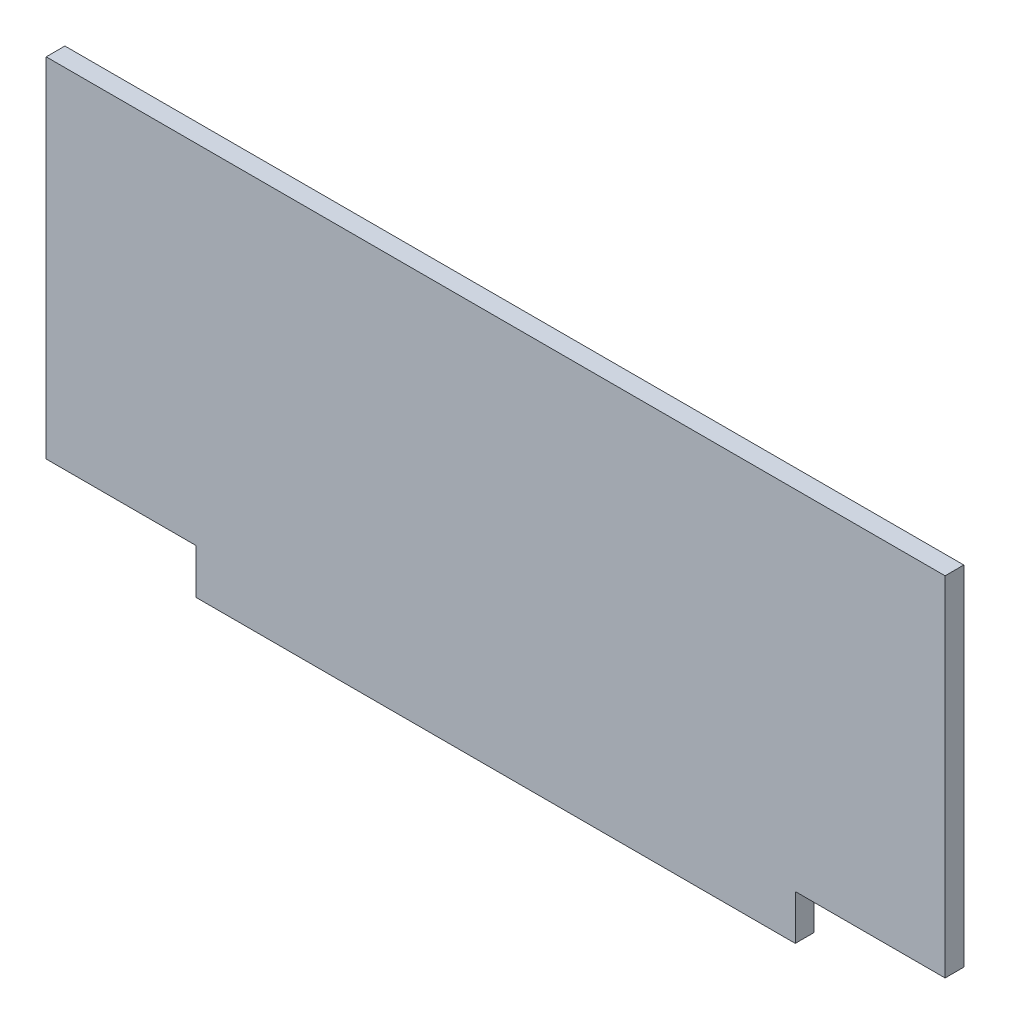
ISO-10303-21;
HEADER;
FILE_DESCRIPTION(('STEP AP214'),'2;1');
FILE_NAME('part.step','',(''),(''),'','','');
FILE_SCHEMA(('AUTOMOTIVE_DESIGN { 1 0 10303 214 1 1 1 1 }'));
ENDSEC;
DATA;
#1=APPLICATION_CONTEXT('core data for automotive mechanical design processes');
#2=APPLICATION_PROTOCOL_DEFINITION('international standard','automotive_design',2000,#1);
#3=PRODUCT_CONTEXT('',#1,'mechanical');
#4=PRODUCT('Part','Part','',(#3));
#5=PRODUCT_RELATED_PRODUCT_CATEGORY('part','',(#4));
#6=PRODUCT_DEFINITION_FORMATION('','',#4);
#7=PRODUCT_DEFINITION_CONTEXT('part definition',#1,'design');
#8=PRODUCT_DEFINITION('design','',#6,#7);
#9=PRODUCT_DEFINITION_SHAPE('','',#8);
#10=(LENGTH_UNIT() NAMED_UNIT(*) SI_UNIT(.MILLI.,.METRE.));
#11=(NAMED_UNIT(*) PLANE_ANGLE_UNIT() SI_UNIT($,.RADIAN.));
#12=(NAMED_UNIT(*) SI_UNIT($,.STERADIAN.) SOLID_ANGLE_UNIT());
#13=UNCERTAINTY_MEASURE_WITH_UNIT(LENGTH_MEASURE(1.E-05),#10,'distance_accuracy_value','');
#14=(GEOMETRIC_REPRESENTATION_CONTEXT(3) GLOBAL_UNCERTAINTY_ASSIGNED_CONTEXT((#13)) GLOBAL_UNIT_ASSIGNED_CONTEXT((#10,
#11,#12)) REPRESENTATION_CONTEXT('',''));
#15=CARTESIAN_POINT('',(0.,0.,0.));
#16=DIRECTION('',(0.,0.,1.));
#17=DIRECTION('',(1.,0.,0.));
#18=AXIS2_PLACEMENT_3D('',#15,#16,#17);
#19=CARTESIAN_POINT('',(-290.,105.,10.));
#20=DIRECTION('',(1.,0.,0.));
#21=DIRECTION('',(0.,0.,-1.));
#22=AXIS2_PLACEMENT_3D('',#19,#20,#21);
#23=PLANE('',#22);
#24=DIRECTION('',(0.,-1.,0.));
#25=VECTOR('',#24,1.);
#26=CARTESIAN_POINT('',(-290.,105.,0.));
#27=LINE('',#26,#25);
#28=CARTESIAN_POINT('',(-290.,105.,0.));
#29=VERTEX_POINT('',#28);
#30=CARTESIAN_POINT('',(-290.,-81.,0.));
#31=VERTEX_POINT('',#30);
#32=EDGE_CURVE('E118',#29,#31,#27,.T.);
#33=ORIENTED_EDGE('',*,*,#32,.T.);
#34=DIRECTION('',(0.,0.,1.));
#35=VECTOR('',#34,1.);
#36=CARTESIAN_POINT('',(-290.,-81.,0.));
#37=LINE('',#36,#35);
#38=CARTESIAN_POINT('',(-290.,-81.,10.));
#39=VERTEX_POINT('',#38);
#40=EDGE_CURVE('E154',#31,#39,#37,.T.);
#41=ORIENTED_EDGE('',*,*,#40,.T.);
#42=DIRECTION('',(0.,-1.,0.));
#43=VECTOR('',#42,1.);
#44=CARTESIAN_POINT('',(-290.,105.,10.));
#45=LINE('',#44,#43);
#46=CARTESIAN_POINT('',(-290.,105.,10.));
#47=VERTEX_POINT('',#46);
#48=EDGE_CURVE('E127',#47,#39,#45,.T.);
#49=ORIENTED_EDGE('',*,*,#48,.F.);
#50=DIRECTION('',(0.,0.,-1.));
#51=VECTOR('',#50,1.);
#52=CARTESIAN_POINT('',(-290.,105.,10.));
#53=LINE('',#52,#51);
#54=EDGE_CURVE('E40',#47,#29,#53,.T.);
#55=ORIENTED_EDGE('',*,*,#54,.T.);
#56=EDGE_LOOP('',(#33,#41,#49,#55));
#57=FACE_BOUND('',#56,.T.);
#58=ADVANCED_FACE('F33',(#57),#23,.F.);
#59=CARTESIAN_POINT('',(-290.,-105.,10.));
#60=DIRECTION('',(0.,1.,0.));
#61=DIRECTION('',(0.,0.,1.));
#62=AXIS2_PLACEMENT_3D('',#59,#60,#61);
#63=PLANE('',#62);
#64=DIRECTION('',(1.,0.,0.));
#65=VECTOR('',#64,1.);
#66=CARTESIAN_POINT('',(-290.,-105.,10.));
#67=LINE('',#66,#65);
#68=CARTESIAN_POINT('',(-210.,-105.,10.));
#69=VERTEX_POINT('',#68);
#70=CARTESIAN_POINT('',(110.,-105.,10.));
#71=VERTEX_POINT('',#70);
#72=EDGE_CURVE('E113',#69,#71,#67,.T.);
#73=ORIENTED_EDGE('',*,*,#72,.F.);
#74=DIRECTION('',(0.,0.,1.));
#75=VECTOR('',#74,1.);
#76=CARTESIAN_POINT('',(-210.,-105.,0.));
#77=LINE('',#76,#75);
#78=CARTESIAN_POINT('',(-210.,-105.,0.));
#79=VERTEX_POINT('',#78);
#80=EDGE_CURVE('E101',#79,#69,#77,.T.);
#81=ORIENTED_EDGE('',*,*,#80,.F.);
#82=DIRECTION('',(1.,0.,0.));
#83=VECTOR('',#82,1.);
#84=CARTESIAN_POINT('',(-290.,-105.,0.));
#85=LINE('',#84,#83);
#86=CARTESIAN_POINT('',(110.,-105.,0.));
#87=VERTEX_POINT('',#86);
#88=EDGE_CURVE('E112',#79,#87,#85,.T.);
#89=ORIENTED_EDGE('',*,*,#88,.T.);
#90=DIRECTION('',(0.,0.,1.));
#91=VECTOR('',#90,1.);
#92=CARTESIAN_POINT('',(110.,-105.,0.));
#93=LINE('',#92,#91);
#94=EDGE_CURVE('E123',#87,#71,#93,.T.);
#95=ORIENTED_EDGE('',*,*,#94,.T.);
#96=EDGE_LOOP('',(#73,#81,#89,#95));
#97=FACE_BOUND('',#96,.T.);
#98=ADVANCED_FACE('F110',(#97),#63,.F.);
#99=CARTESIAN_POINT('',(190.,105.,10.));
#100=DIRECTION('',(-1.,0.,0.));
#101=DIRECTION('',(0.,-1.,0.));
#102=AXIS2_PLACEMENT_3D('',#99,#100,#101);
#103=PLANE('',#102);
#104=DIRECTION('',(0.,1.,0.));
#105=VECTOR('',#104,1.);
#106=CARTESIAN_POINT('',(190.,105.,10.));
#107=LINE('',#106,#105);
#108=CARTESIAN_POINT('',(190.,-81.,10.));
#109=VERTEX_POINT('',#108);
#110=CARTESIAN_POINT('',(190.,105.,10.));
#111=VERTEX_POINT('',#110);
#112=EDGE_CURVE('E134',#109,#111,#107,.T.);
#113=ORIENTED_EDGE('',*,*,#112,.F.);
#114=DIRECTION('',(0.,0.,1.));
#115=VECTOR('',#114,1.);
#116=CARTESIAN_POINT('',(190.,-81.,0.));
#117=LINE('',#116,#115);
#118=CARTESIAN_POINT('',(190.,-81.,0.));
#119=VERTEX_POINT('',#118);
#120=EDGE_CURVE('E142',#119,#109,#117,.T.);
#121=ORIENTED_EDGE('',*,*,#120,.F.);
#122=DIRECTION('',(0.,1.,0.));
#123=VECTOR('',#122,1.);
#124=CARTESIAN_POINT('',(190.,105.,0.));
#125=LINE('',#124,#123);
#126=CARTESIAN_POINT('',(190.,105.,0.));
#127=VERTEX_POINT('',#126);
#128=EDGE_CURVE('E117',#119,#127,#125,.T.);
#129=ORIENTED_EDGE('',*,*,#128,.T.);
#130=DIRECTION('',(0.,0.,-1.));
#131=VECTOR('',#130,1.);
#132=CARTESIAN_POINT('',(190.,105.,10.));
#133=LINE('',#132,#131);
#134=EDGE_CURVE('E11',#111,#127,#133,.T.);
#135=ORIENTED_EDGE('',*,*,#134,.F.);
#136=EDGE_LOOP('',(#113,#121,#129,#135));
#137=FACE_BOUND('',#136,.T.);
#138=ADVANCED_FACE('F183',(#137),#103,.F.);
#139=CARTESIAN_POINT('',(-290.,105.,10.));
#140=DIRECTION('',(0.,-1.,0.));
#141=DIRECTION('',(1.,0.,0.));
#142=AXIS2_PLACEMENT_3D('',#139,#140,#141);
#143=PLANE('',#142);
#144=DIRECTION('',(-1.,0.,0.));
#145=VECTOR('',#144,1.);
#146=CARTESIAN_POINT('',(-290.,105.,0.));
#147=LINE('',#146,#145);
#148=EDGE_CURVE('E120',#127,#29,#147,.T.);
#149=ORIENTED_EDGE('',*,*,#148,.T.);
#150=ORIENTED_EDGE('',*,*,#54,.F.);
#151=DIRECTION('',(-1.,0.,0.));
#152=VECTOR('',#151,1.);
#153=CARTESIAN_POINT('',(-290.,105.,10.));
#154=LINE('',#153,#152);
#155=EDGE_CURVE('E129',#111,#47,#154,.T.);
#156=ORIENTED_EDGE('',*,*,#155,.F.);
#157=ORIENTED_EDGE('',*,*,#134,.T.);
#158=EDGE_LOOP('',(#149,#150,#156,#157));
#159=FACE_BOUND('',#158,.T.);
#160=ADVANCED_FACE('F187',(#159),#143,.F.);
#161=CARTESIAN_POINT('',(0.,0.,10.));
#162=DIRECTION('',(0.,0.,1.));
#163=DIRECTION('',(1.,0.,0.));
#164=AXIS2_PLACEMENT_3D('',#161,#162,#163);
#165=PLANE('',#164);
#166=DIRECTION('',(-1.,0.,0.));
#167=VECTOR('',#166,1.);
#168=CARTESIAN_POINT('',(-290.,-81.,10.));
#169=LINE('',#168,#167);
#170=CARTESIAN_POINT('',(-210.,-81.,10.));
#171=VERTEX_POINT('',#170);
#172=EDGE_CURVE('E106',#171,#39,#169,.T.);
#173=ORIENTED_EDGE('',*,*,#172,.F.);
#174=DIRECTION('',(0.,1.,0.));
#175=VECTOR('',#174,1.);
#176=CARTESIAN_POINT('',(-210.,-105.,10.));
#177=LINE('',#176,#175);
#178=EDGE_CURVE('E161',#69,#171,#177,.T.);
#179=ORIENTED_EDGE('',*,*,#178,.F.);
#180=ORIENTED_EDGE('',*,*,#72,.T.);
#181=DIRECTION('',(0.,-1.,0.));
#182=VECTOR('',#181,1.);
#183=CARTESIAN_POINT('',(110.,-105.,10.));
#184=LINE('',#183,#182);
#185=CARTESIAN_POINT('',(110.,-81.,10.));
#186=VERTEX_POINT('',#185);
#187=EDGE_CURVE('E147',#186,#71,#184,.T.);
#188=ORIENTED_EDGE('',*,*,#187,.F.);
#189=DIRECTION('',(-1.,0.,0.));
#190=VECTOR('',#189,1.);
#191=CARTESIAN_POINT('',(190.,-81.,10.));
#192=LINE('',#191,#190);
#193=EDGE_CURVE('E151',#109,#186,#192,.T.);
#194=ORIENTED_EDGE('',*,*,#193,.F.);
#195=ORIENTED_EDGE('',*,*,#112,.T.);
#196=ORIENTED_EDGE('',*,*,#155,.T.);
#197=ORIENTED_EDGE('',*,*,#48,.T.);
#198=EDGE_LOOP('',(#173,#179,#180,#188,#194,#195,#196,#197));
#199=FACE_BOUND('',#198,.T.);
#200=ADVANCED_FACE('F165',(#199),#165,.T.);
#201=CARTESIAN_POINT('',(0.,0.,0.));
#202=DIRECTION('',(0.,0.,1.));
#203=DIRECTION('',(1.,0.,0.));
#204=AXIS2_PLACEMENT_3D('',#201,#202,#203);
#205=PLANE('',#204);
#206=DIRECTION('',(0.,1.,0.));
#207=VECTOR('',#206,1.);
#208=CARTESIAN_POINT('',(-210.,-105.,0.));
#209=LINE('',#208,#207);
#210=CARTESIAN_POINT('',(-210.,-81.,0.));
#211=VERTEX_POINT('',#210);
#212=EDGE_CURVE('E97',#79,#211,#209,.T.);
#213=ORIENTED_EDGE('',*,*,#212,.T.);
#214=DIRECTION('',(-1.,0.,0.));
#215=VECTOR('',#214,1.);
#216=CARTESIAN_POINT('',(-290.,-81.,0.));
#217=LINE('',#216,#215);
#218=EDGE_CURVE('E47',#211,#31,#217,.T.);
#219=ORIENTED_EDGE('',*,*,#218,.T.);
#220=ORIENTED_EDGE('',*,*,#32,.F.);
#221=ORIENTED_EDGE('',*,*,#148,.F.);
#222=ORIENTED_EDGE('',*,*,#128,.F.);
#223=DIRECTION('',(-1.,0.,0.));
#224=VECTOR('',#223,1.);
#225=CARTESIAN_POINT('',(190.,-81.,0.));
#226=LINE('',#225,#224);
#227=CARTESIAN_POINT('',(110.,-81.,0.));
#228=VERTEX_POINT('',#227);
#229=EDGE_CURVE('E150',#119,#228,#226,.T.);
#230=ORIENTED_EDGE('',*,*,#229,.T.);
#231=DIRECTION('',(0.,-1.,0.));
#232=VECTOR('',#231,1.);
#233=CARTESIAN_POINT('',(110.,-105.,0.));
#234=LINE('',#233,#232);
#235=EDGE_CURVE('E55',#228,#87,#234,.T.);
#236=ORIENTED_EDGE('',*,*,#235,.T.);
#237=ORIENTED_EDGE('',*,*,#88,.F.);
#238=EDGE_LOOP('',(#213,#219,#220,#221,#222,#230,#236,#237));
#239=FACE_BOUND('',#238,.T.);
#240=ADVANCED_FACE('F115',(#239),#205,.F.);
#241=CARTESIAN_POINT('',(110.,-105.,0.));
#242=DIRECTION('',(-1.,0.,0.));
#243=DIRECTION('',(0.,0.,1.));
#244=AXIS2_PLACEMENT_3D('',#241,#242,#243);
#245=PLANE('',#244);
#246=ORIENTED_EDGE('',*,*,#187,.T.);
#247=ORIENTED_EDGE('',*,*,#94,.F.);
#248=ORIENTED_EDGE('',*,*,#235,.F.);
#249=DIRECTION('',(0.,0.,1.));
#250=VECTOR('',#249,1.);
#251=CARTESIAN_POINT('',(110.,-81.,0.));
#252=LINE('',#251,#250);
#253=EDGE_CURVE('E144',#228,#186,#252,.T.);
#254=ORIENTED_EDGE('',*,*,#253,.T.);
#255=EDGE_LOOP('',(#246,#247,#248,#254));
#256=FACE_BOUND('',#255,.T.);
#257=ADVANCED_FACE('F175',(#256),#245,.F.);
#258=CARTESIAN_POINT('',(190.,-81.,0.));
#259=DIRECTION('',(0.,1.,0.));
#260=DIRECTION('',(0.,0.,1.));
#261=AXIS2_PLACEMENT_3D('',#258,#259,#260);
#262=PLANE('',#261);
#263=ORIENTED_EDGE('',*,*,#193,.T.);
#264=ORIENTED_EDGE('',*,*,#253,.F.);
#265=ORIENTED_EDGE('',*,*,#229,.F.);
#266=ORIENTED_EDGE('',*,*,#120,.T.);
#267=EDGE_LOOP('',(#263,#264,#265,#266));
#268=FACE_BOUND('',#267,.T.);
#269=ADVANCED_FACE('F168',(#268),#262,.F.);
#270=CARTESIAN_POINT('',(-290.,-81.,0.));
#271=DIRECTION('',(0.,1.,0.));
#272=DIRECTION('',(0.,0.,1.));
#273=AXIS2_PLACEMENT_3D('',#270,#271,#272);
#274=PLANE('',#273);
#275=ORIENTED_EDGE('',*,*,#172,.T.);
#276=ORIENTED_EDGE('',*,*,#40,.F.);
#277=ORIENTED_EDGE('',*,*,#218,.F.);
#278=DIRECTION('',(0.,0.,1.));
#279=VECTOR('',#278,1.);
#280=CARTESIAN_POINT('',(-210.,-81.,0.));
#281=LINE('',#280,#279);
#282=EDGE_CURVE('E103',#211,#171,#281,.T.);
#283=ORIENTED_EDGE('',*,*,#282,.T.);
#284=EDGE_LOOP('',(#275,#276,#277,#283));
#285=FACE_BOUND('',#284,.T.);
#286=ADVANCED_FACE('F166',(#285),#274,.F.);
#287=CARTESIAN_POINT('',(-210.,-105.,0.));
#288=DIRECTION('',(1.,0.,0.));
#289=DIRECTION('',(0.,0.,-1.));
#290=AXIS2_PLACEMENT_3D('',#287,#288,#289);
#291=PLANE('',#290);
#292=ORIENTED_EDGE('',*,*,#178,.T.);
#293=ORIENTED_EDGE('',*,*,#282,.F.);
#294=ORIENTED_EDGE('',*,*,#212,.F.);
#295=ORIENTED_EDGE('',*,*,#80,.T.);
#296=EDGE_LOOP('',(#292,#293,#294,#295));
#297=FACE_BOUND('',#296,.T.);
#298=ADVANCED_FACE('F100',(#297),#291,.F.);
#299=CLOSED_SHELL('',(#58,#98,#138,#160,#200,#240,#257,#269,#286,#298));
#300=MANIFOLD_SOLID_BREP('B2',#299);
#301=ADVANCED_BREP_SHAPE_REPRESENTATION('',(#18,#300),#14);
#302=SHAPE_DEFINITION_REPRESENTATION(#9,#301);
ENDSEC;
END-ISO-10303-21;
